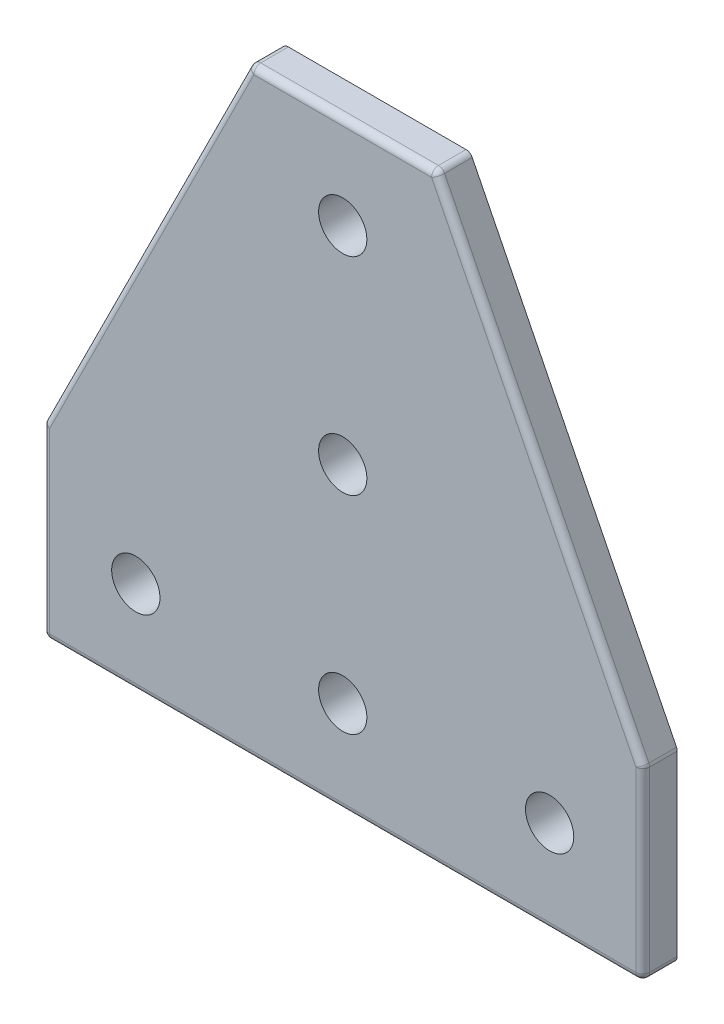
ISO-10303-21;
HEADER;
FILE_DESCRIPTION(('STEP AP214'),'2;1');
FILE_NAME('part.step','',(''),(''),'','','');
FILE_SCHEMA(('AUTOMOTIVE_DESIGN { 1 0 10303 214 1 1 1 1 }'));
ENDSEC;
DATA;
#1=APPLICATION_CONTEXT('core data for automotive mechanical design processes');
#2=APPLICATION_PROTOCOL_DEFINITION('international standard','automotive_design',2000,#1);
#3=PRODUCT_CONTEXT('',#1,'mechanical');
#4=PRODUCT('Part','Part','',(#3));
#5=PRODUCT_RELATED_PRODUCT_CATEGORY('part','',(#4));
#6=PRODUCT_DEFINITION_FORMATION('','',#4);
#7=PRODUCT_DEFINITION_CONTEXT('part definition',#1,'design');
#8=PRODUCT_DEFINITION('design','',#6,#7);
#9=PRODUCT_DEFINITION_SHAPE('','',#8);
#10=(LENGTH_UNIT() NAMED_UNIT(*) SI_UNIT(.MILLI.,.METRE.));
#11=(NAMED_UNIT(*) PLANE_ANGLE_UNIT() SI_UNIT($,.RADIAN.));
#12=(NAMED_UNIT(*) SI_UNIT($,.STERADIAN.) SOLID_ANGLE_UNIT());
#13=UNCERTAINTY_MEASURE_WITH_UNIT(LENGTH_MEASURE(1.E-05),#10,'distance_accuracy_value','');
#14=(GEOMETRIC_REPRESENTATION_CONTEXT(3) GLOBAL_UNCERTAINTY_ASSIGNED_CONTEXT((#13)) GLOBAL_UNIT_ASSIGNED_CONTEXT((#10,
#11,#12)) REPRESENTATION_CONTEXT('',''));
#15=CARTESIAN_POINT('',(0.,0.,0.));
#16=DIRECTION('',(0.,0.,1.));
#17=DIRECTION('',(1.,0.,0.));
#18=AXIS2_PLACEMENT_3D('',#15,#16,#17);
#19=CARTESIAN_POINT('',(0.,0.,2.5));
#20=DIRECTION('',(0.,0.,-1.));
#21=DIRECTION('',(-1.,0.,0.));
#22=AXIS2_PLACEMENT_3D('',#19,#20,#21);
#23=PLANE('',#22);
#24=DIRECTION('',(-0.447213595499958,-0.894427190999916,0.));
#25=VECTOR('',#24,1.);
#26=CARTESIAN_POINT('',(-9.90557280900008,4.95278640450004,2.5));
#27=LINE('',#26,#25);
#28=CARTESIAN_POINT('',(30.6180339887499,86.,2.5));
#29=VERTEX_POINT('',#28);
#30=CARTESIAN_POINT('',(0.999999999999997,26.7639320225002,2.5));
#31=VERTEX_POINT('',#30);
#32=EDGE_CURVE('E214',#29,#31,#27,.T.);
#33=ORIENTED_EDGE('',*,*,#32,.T.);
#34=DIRECTION('',(0.,-1.,0.));
#35=VECTOR('',#34,1.);
#36=CARTESIAN_POINT('',(1.,0.,2.5));
#37=LINE('',#36,#35);
#38=CARTESIAN_POINT('',(1.,1.,2.5));
#39=VERTEX_POINT('',#38);
#40=EDGE_CURVE('E251',#31,#39,#37,.T.);
#41=ORIENTED_EDGE('',*,*,#40,.T.);
#42=DIRECTION('',(1.,0.,0.));
#43=VECTOR('',#42,1.);
#44=CARTESIAN_POINT('',(0.,1.,2.5));
#45=LINE('',#44,#43);
#46=CARTESIAN_POINT('',(86.,1.,2.5));
#47=VERTEX_POINT('',#46);
#48=EDGE_CURVE('E249',#39,#47,#45,.T.);
#49=ORIENTED_EDGE('',*,*,#48,.T.);
#50=DIRECTION('',(0.,1.,0.));
#51=VECTOR('',#50,1.);
#52=CARTESIAN_POINT('',(86.,0.,2.5));
#53=LINE('',#52,#51);
#54=CARTESIAN_POINT('',(86.,26.7639320225002,2.5));
#55=VERTEX_POINT('',#54);
#56=EDGE_CURVE('E210',#47,#55,#53,.T.);
#57=ORIENTED_EDGE('',*,*,#56,.T.);
#58=DIRECTION('',(-0.447213595499958,0.894427190999916,0.));
#59=VECTOR('',#58,1.);
#60=CARTESIAN_POINT('',(79.5055728090001,39.7527864045,2.5));
#61=LINE('',#60,#59);
#62=CARTESIAN_POINT('',(56.3819660112501,86.,2.5));
#63=VERTEX_POINT('',#62);
#64=EDGE_CURVE('E202',#55,#63,#61,.T.);
#65=ORIENTED_EDGE('',*,*,#64,.T.);
#66=DIRECTION('',(-1.,0.,0.));
#67=VECTOR('',#66,1.);
#68=CARTESIAN_POINT('',(0.,86.,2.5));
#69=LINE('',#68,#67);
#70=EDGE_CURVE('E207',#63,#29,#69,.T.);
#71=ORIENTED_EDGE('',*,*,#70,.T.);
#72=EDGE_LOOP('',(#33,#41,#49,#57,#65,#71));
#73=FACE_BOUND('',#72,.T.);
#74=CARTESIAN_POINT('',(43.5,43.5,2.5));
#75=DIRECTION('',(0.,0.,1.));
#76=DIRECTION('',(1.,0.,0.));
#77=AXIS2_PLACEMENT_3D('',#74,#75,#76);
#78=CIRCLE('',#77,3.5);
#79=CARTESIAN_POINT('',(47.,43.5,2.5));
#80=VERTEX_POINT('',#79);
#81=EDGE_CURVE('E344',#80,#80,#78,.T.);
#82=ORIENTED_EDGE('',*,*,#81,.F.);
#83=EDGE_LOOP('',(#82));
#84=FACE_BOUND('',#83,.T.);
#85=CARTESIAN_POINT('',(43.5,13.5,2.5));
#86=DIRECTION('',(0.,0.,1.));
#87=DIRECTION('',(1.,0.,0.));
#88=AXIS2_PLACEMENT_3D('',#85,#86,#87);
#89=CIRCLE('',#88,3.5);
#90=CARTESIAN_POINT('',(47.,13.5,2.5));
#91=VERTEX_POINT('',#90);
#92=EDGE_CURVE('E356',#91,#91,#89,.T.);
#93=ORIENTED_EDGE('',*,*,#92,.F.);
#94=EDGE_LOOP('',(#93));
#95=FACE_BOUND('',#94,.T.);
#96=CARTESIAN_POINT('',(13.5,13.5,2.5));
#97=DIRECTION('',(0.,0.,1.));
#98=DIRECTION('',(1.,0.,0.));
#99=AXIS2_PLACEMENT_3D('',#96,#97,#98);
#100=CIRCLE('',#99,3.5);
#101=CARTESIAN_POINT('',(17.,13.5,2.5));
#102=VERTEX_POINT('',#101);
#103=EDGE_CURVE('E362',#102,#102,#100,.T.);
#104=ORIENTED_EDGE('',*,*,#103,.F.);
#105=EDGE_LOOP('',(#104));
#106=FACE_BOUND('',#105,.T.);
#107=CARTESIAN_POINT('',(73.5,13.5,2.5));
#108=DIRECTION('',(0.,0.,1.));
#109=DIRECTION('',(1.,0.,0.));
#110=AXIS2_PLACEMENT_3D('',#107,#108,#109);
#111=CIRCLE('',#110,3.50000000000001);
#112=CARTESIAN_POINT('',(77.,13.5,2.5));
#113=VERTEX_POINT('',#112);
#114=EDGE_CURVE('E350',#113,#113,#111,.T.);
#115=ORIENTED_EDGE('',*,*,#114,.F.);
#116=EDGE_LOOP('',(#115));
#117=FACE_BOUND('',#116,.T.);
#118=CARTESIAN_POINT('',(43.5,73.5,2.5));
#119=DIRECTION('',(0.,0.,1.));
#120=DIRECTION('',(1.,0.,0.));
#121=AXIS2_PLACEMENT_3D('',#118,#119,#120);
#122=CIRCLE('',#121,3.5);
#123=CARTESIAN_POINT('',(47.,73.5,2.5));
#124=VERTEX_POINT('',#123);
#125=EDGE_CURVE('E336',#124,#124,#122,.T.);
#126=ORIENTED_EDGE('',*,*,#125,.F.);
#127=EDGE_LOOP('',(#126));
#128=FACE_BOUND('',#127,.T.);
#129=ADVANCED_FACE('F96',(#73,#84,#95,#106,#117,#128),#23,.F.);
#130=CARTESIAN_POINT('',(0.,0.,-2.5));
#131=DIRECTION('',(0.,0.,-1.));
#132=DIRECTION('',(-1.,0.,0.));
#133=AXIS2_PLACEMENT_3D('',#130,#131,#132);
#134=PLANE('',#133);
#135=CARTESIAN_POINT('',(43.5,43.5,-2.5));
#136=DIRECTION('',(0.,0.,1.));
#137=DIRECTION('',(1.,0.,0.));
#138=AXIS2_PLACEMENT_3D('',#135,#136,#137);
#139=CIRCLE('',#138,3.5);
#140=CARTESIAN_POINT('',(47.,43.5,-2.5));
#141=VERTEX_POINT('',#140);
#142=EDGE_CURVE('E341',#141,#141,#139,.T.);
#143=ORIENTED_EDGE('',*,*,#142,.T.);
#144=EDGE_LOOP('',(#143));
#145=FACE_BOUND('',#144,.T.);
#146=CARTESIAN_POINT('',(43.5,13.5,-2.5));
#147=DIRECTION('',(0.,0.,1.));
#148=DIRECTION('',(1.,0.,0.));
#149=AXIS2_PLACEMENT_3D('',#146,#147,#148);
#150=CIRCLE('',#149,3.5);
#151=CARTESIAN_POINT('',(47.,13.5,-2.5));
#152=VERTEX_POINT('',#151);
#153=EDGE_CURVE('E353',#152,#152,#150,.T.);
#154=ORIENTED_EDGE('',*,*,#153,.T.);
#155=EDGE_LOOP('',(#154));
#156=FACE_BOUND('',#155,.T.);
#157=DIRECTION('',(-0.447213595499958,-0.894427190999916,0.));
#158=VECTOR('',#157,1.);
#159=CARTESIAN_POINT('',(0.,27.,-2.5));
#160=LINE('',#159,#158);
#161=CARTESIAN_POINT('',(29.72360679775,86.4472135954999,-2.5));
#162=VERTEX_POINT('',#161);
#163=CARTESIAN_POINT('',(0.105572809000081,27.2111456180001,-2.5));
#164=VERTEX_POINT('',#163);
#165=EDGE_CURVE('E243',#162,#164,#160,.T.);
#166=ORIENTED_EDGE('',*,*,#165,.F.);
#167=CARTESIAN_POINT('',(30.6180339887499,86.,-2.5));
#168=DIRECTION('',(0.,0.,-1.));
#169=DIRECTION('',(-1.,0.,0.));
#170=AXIS2_PLACEMENT_3D('',#167,#168,#169);
#171=CIRCLE('',#170,1.);
#172=CARTESIAN_POINT('',(30.6180339887499,87.,-2.5));
#173=VERTEX_POINT('',#172);
#174=EDGE_CURVE('E270',#162,#173,#171,.T.);
#175=ORIENTED_EDGE('',*,*,#174,.T.);
#176=DIRECTION('',(-1.,0.,0.));
#177=VECTOR('',#176,1.);
#178=CARTESIAN_POINT('',(57.,87.,-2.5));
#179=LINE('',#178,#177);
#180=CARTESIAN_POINT('',(56.3819660112501,87.,-2.5));
#181=VERTEX_POINT('',#180);
#182=EDGE_CURVE('E375',#181,#173,#179,.T.);
#183=ORIENTED_EDGE('',*,*,#182,.F.);
#184=CARTESIAN_POINT('',(56.3819660112501,86.,-2.5));
#185=DIRECTION('',(0.,0.,-1.));
#186=DIRECTION('',(-1.,0.,0.));
#187=AXIS2_PLACEMENT_3D('',#184,#185,#186);
#188=CIRCLE('',#187,1.);
#189=CARTESIAN_POINT('',(57.27639320225,86.4472135954999,-2.5));
#190=VERTEX_POINT('',#189);
#191=EDGE_CURVE('E264',#181,#190,#188,.T.);
#192=ORIENTED_EDGE('',*,*,#191,.T.);
#193=DIRECTION('',(-0.447213595499958,0.894427190999916,0.));
#194=VECTOR('',#193,1.);
#195=CARTESIAN_POINT('',(57.,87.,-2.5));
#196=LINE('',#195,#194);
#197=CARTESIAN_POINT('',(86.8944271909999,27.2111456180002,-2.5));
#198=VERTEX_POINT('',#197);
#199=EDGE_CURVE('E372',#198,#190,#196,.T.);
#200=ORIENTED_EDGE('',*,*,#199,.F.);
#201=CARTESIAN_POINT('',(86.,26.7639320225002,-2.5));
#202=DIRECTION('',(0.,0.,-1.));
#203=DIRECTION('',(-1.,0.,0.));
#204=AXIS2_PLACEMENT_3D('',#201,#202,#203);
#205=CIRCLE('',#204,1.);
#206=CARTESIAN_POINT('',(87.,26.7639320225002,-2.5));
#207=VERTEX_POINT('',#206);
#208=EDGE_CURVE('E266',#198,#207,#205,.T.);
#209=ORIENTED_EDGE('',*,*,#208,.T.);
#210=DIRECTION('',(0.,1.,0.));
#211=VECTOR('',#210,1.);
#212=CARTESIAN_POINT('',(87.,27.,-2.5));
#213=LINE('',#212,#211);
#214=CARTESIAN_POINT('',(87.,1.,-2.5));
#215=VERTEX_POINT('',#214);
#216=EDGE_CURVE('E369',#215,#207,#213,.T.);
#217=ORIENTED_EDGE('',*,*,#216,.F.);
#218=CARTESIAN_POINT('',(86.,1.,-2.5));
#219=DIRECTION('',(0.,0.,-1.));
#220=DIRECTION('',(-1.,0.,0.));
#221=AXIS2_PLACEMENT_3D('',#218,#219,#220);
#222=CIRCLE('',#221,1.);
#223=CARTESIAN_POINT('',(86.,0.,-2.5));
#224=VERTEX_POINT('',#223);
#225=EDGE_CURVE('E260',#215,#224,#222,.T.);
#226=ORIENTED_EDGE('',*,*,#225,.T.);
#227=DIRECTION('',(1.,0.,0.));
#228=VECTOR('',#227,1.);
#229=CARTESIAN_POINT('',(87.,0.,-2.5));
#230=LINE('',#229,#228);
#231=CARTESIAN_POINT('',(1.,0.,-2.5));
#232=VERTEX_POINT('',#231);
#233=EDGE_CURVE('E365',#232,#224,#230,.T.);
#234=ORIENTED_EDGE('',*,*,#233,.F.);
#235=CARTESIAN_POINT('',(1.,1.,-2.5));
#236=DIRECTION('',(0.,0.,-1.));
#237=DIRECTION('',(-1.,0.,0.));
#238=AXIS2_PLACEMENT_3D('',#235,#236,#237);
#239=CIRCLE('',#238,1.);
#240=CARTESIAN_POINT('',(0.,1.,-2.5));
#241=VERTEX_POINT('',#240);
#242=EDGE_CURVE('E262',#232,#241,#239,.T.);
#243=ORIENTED_EDGE('',*,*,#242,.T.);
#244=DIRECTION('',(0.,-1.,0.));
#245=VECTOR('',#244,1.);
#246=CARTESIAN_POINT('',(0.,0.,-2.5));
#247=LINE('',#246,#245);
#248=CARTESIAN_POINT('',(0.,26.7639320225002,-2.5));
#249=VERTEX_POINT('',#248);
#250=EDGE_CURVE('E240',#249,#241,#247,.T.);
#251=ORIENTED_EDGE('',*,*,#250,.F.);
#252=CARTESIAN_POINT('',(0.999999999999997,26.7639320225002,-2.5));
#253=DIRECTION('',(0.,0.,-1.));
#254=DIRECTION('',(-1.,0.,0.));
#255=AXIS2_PLACEMENT_3D('',#252,#253,#254);
#256=CIRCLE('',#255,1.);
#257=EDGE_CURVE('E268',#249,#164,#256,.T.);
#258=ORIENTED_EDGE('',*,*,#257,.T.);
#259=EDGE_LOOP('',(#166,#175,#183,#192,#200,#209,#217,#226,#234,#243,#251,#258));
#260=FACE_BOUND('',#259,.T.);
#261=CARTESIAN_POINT('',(13.5,13.5,-2.5));
#262=DIRECTION('',(0.,0.,1.));
#263=DIRECTION('',(1.,0.,0.));
#264=AXIS2_PLACEMENT_3D('',#261,#262,#263);
#265=CIRCLE('',#264,3.5);
#266=CARTESIAN_POINT('',(17.,13.5,-2.5));
#267=VERTEX_POINT('',#266);
#268=EDGE_CURVE('E359',#267,#267,#265,.T.);
#269=ORIENTED_EDGE('',*,*,#268,.T.);
#270=EDGE_LOOP('',(#269));
#271=FACE_BOUND('',#270,.T.);
#272=CARTESIAN_POINT('',(73.5,13.5,-2.5));
#273=DIRECTION('',(0.,0.,1.));
#274=DIRECTION('',(1.,0.,0.));
#275=AXIS2_PLACEMENT_3D('',#272,#273,#274);
#276=CIRCLE('',#275,3.50000000000001);
#277=CARTESIAN_POINT('',(77.,13.5,-2.5));
#278=VERTEX_POINT('',#277);
#279=EDGE_CURVE('E347',#278,#278,#276,.T.);
#280=ORIENTED_EDGE('',*,*,#279,.T.);
#281=EDGE_LOOP('',(#280));
#282=FACE_BOUND('',#281,.T.);
#283=CARTESIAN_POINT('',(43.5,73.5,-2.5));
#284=DIRECTION('',(0.,0.,1.));
#285=DIRECTION('',(1.,0.,0.));
#286=AXIS2_PLACEMENT_3D('',#283,#284,#285);
#287=CIRCLE('',#286,3.5);
#288=CARTESIAN_POINT('',(47.,73.5,-2.5));
#289=VERTEX_POINT('',#288);
#290=EDGE_CURVE('E333',#289,#289,#287,.T.);
#291=ORIENTED_EDGE('',*,*,#290,.T.);
#292=EDGE_LOOP('',(#291));
#293=FACE_BOUND('',#292,.T.);
#294=ADVANCED_FACE('F417',(#145,#156,#260,#271,#282,#293),#134,.T.);
#295=CARTESIAN_POINT('',(87.,0.,2.5));
#296=DIRECTION('',(0.,1.,0.));
#297=DIRECTION('',(-1.,0.,0.));
#298=AXIS2_PLACEMENT_3D('',#295,#296,#297);
#299=PLANE('',#298);
#300=DIRECTION('',(1.,0.,0.));
#301=VECTOR('',#300,1.);
#302=CARTESIAN_POINT('',(87.,0.,1.5));
#303=LINE('',#302,#301);
#304=CARTESIAN_POINT('',(86.,0.,1.5));
#305=VERTEX_POINT('',#304);
#306=CARTESIAN_POINT('',(1.,0.,1.5));
#307=VERTEX_POINT('',#306);
#308=EDGE_CURVE('E105',#305,#307,#303,.F.);
#309=ORIENTED_EDGE('',*,*,#308,.T.);
#310=DIRECTION('',(0.,0.,-1.));
#311=VECTOR('',#310,1.);
#312=CARTESIAN_POINT('',(1.,0.,2.5));
#313=LINE('',#312,#311);
#314=EDGE_CURVE('E12',#307,#232,#313,.T.);
#315=ORIENTED_EDGE('',*,*,#314,.T.);
#316=ORIENTED_EDGE('',*,*,#233,.T.);
#317=DIRECTION('',(0.,0.,-1.));
#318=VECTOR('',#317,1.);
#319=CARTESIAN_POINT('',(86.,0.,2.5));
#320=LINE('',#319,#318);
#321=EDGE_CURVE('E116',#224,#305,#320,.F.);
#322=ORIENTED_EDGE('',*,*,#321,.T.);
#323=EDGE_LOOP('',(#309,#315,#316,#322));
#324=FACE_BOUND('',#323,.T.);
#325=ADVANCED_FACE('F416',(#324),#299,.F.);
#326=CARTESIAN_POINT('',(87.,27.,2.5));
#327=DIRECTION('',(-1.,0.,0.));
#328=DIRECTION('',(0.,0.,1.));
#329=AXIS2_PLACEMENT_3D('',#326,#327,#328);
#330=PLANE('',#329);
#331=ORIENTED_EDGE('',*,*,#216,.T.);
#332=DIRECTION('',(0.,0.,-1.));
#333=VECTOR('',#332,1.);
#334=CARTESIAN_POINT('',(87.,26.7639320225002,2.5));
#335=LINE('',#334,#333);
#336=CARTESIAN_POINT('',(87.,26.7639320225002,1.5));
#337=VERTEX_POINT('',#336);
#338=EDGE_CURVE('E293',#207,#337,#335,.F.);
#339=ORIENTED_EDGE('',*,*,#338,.T.);
#340=DIRECTION('',(0.,1.,0.));
#341=VECTOR('',#340,1.);
#342=CARTESIAN_POINT('',(87.,27.,1.5));
#343=LINE('',#342,#341);
#344=CARTESIAN_POINT('',(87.,1.,1.5));
#345=VERTEX_POINT('',#344);
#346=EDGE_CURVE('E291',#337,#345,#343,.F.);
#347=ORIENTED_EDGE('',*,*,#346,.T.);
#348=DIRECTION('',(0.,0.,-1.));
#349=VECTOR('',#348,1.);
#350=CARTESIAN_POINT('',(87.,1.,2.5));
#351=LINE('',#350,#349);
#352=EDGE_CURVE('E289',#345,#215,#351,.T.);
#353=ORIENTED_EDGE('',*,*,#352,.T.);
#354=EDGE_LOOP('',(#331,#339,#347,#353));
#355=FACE_BOUND('',#354,.T.);
#356=ADVANCED_FACE('F465',(#355),#330,.F.);
#357=CARTESIAN_POINT('',(57.,87.,2.5));
#358=DIRECTION('',(-0.894427190999916,-0.447213595499958,0.));
#359=DIRECTION('',(0.447213595499958,-0.894427190999916,0.));
#360=AXIS2_PLACEMENT_3D('',#357,#358,#359);
#361=PLANE('',#360);
#362=DIRECTION('',(-0.447213595499958,0.894427190999916,0.));
#363=VECTOR('',#362,1.);
#364=CARTESIAN_POINT('',(57.,87.,1.5));
#365=LINE('',#364,#363);
#366=CARTESIAN_POINT('',(57.27639320225,86.4472135954999,1.5));
#367=VERTEX_POINT('',#366);
#368=CARTESIAN_POINT('',(86.8944271909999,27.2111456180002,1.5));
#369=VERTEX_POINT('',#368);
#370=EDGE_CURVE('E221',#367,#369,#365,.F.);
#371=ORIENTED_EDGE('',*,*,#370,.T.);
#372=DIRECTION('',(0.,0.,-1.));
#373=VECTOR('',#372,1.);
#374=CARTESIAN_POINT('',(86.8944271909999,27.2111456180002,2.5));
#375=LINE('',#374,#373);
#376=EDGE_CURVE('E287',#369,#198,#375,.T.);
#377=ORIENTED_EDGE('',*,*,#376,.T.);
#378=ORIENTED_EDGE('',*,*,#199,.T.);
#379=DIRECTION('',(0.,0.,-1.));
#380=VECTOR('',#379,1.);
#381=CARTESIAN_POINT('',(57.27639320225,86.4472135954999,2.5));
#382=LINE('',#381,#380);
#383=EDGE_CURVE('E284',#190,#367,#382,.F.);
#384=ORIENTED_EDGE('',*,*,#383,.T.);
#385=EDGE_LOOP('',(#371,#377,#378,#384));
#386=FACE_BOUND('',#385,.T.);
#387=ADVANCED_FACE('F461',(#386),#361,.F.);
#388=CARTESIAN_POINT('',(57.,87.,2.5));
#389=DIRECTION('',(0.,-1.,0.));
#390=DIRECTION('',(0.,0.,-1.));
#391=AXIS2_PLACEMENT_3D('',#388,#389,#390);
#392=PLANE('',#391);
#393=ORIENTED_EDGE('',*,*,#182,.T.);
#394=DIRECTION('',(0.,0.,-1.));
#395=VECTOR('',#394,1.);
#396=CARTESIAN_POINT('',(30.6180339887499,87.,2.5));
#397=LINE('',#396,#395);
#398=CARTESIAN_POINT('',(30.6180339887499,87.,1.5));
#399=VERTEX_POINT('',#398);
#400=EDGE_CURVE('E276',#173,#399,#397,.F.);
#401=ORIENTED_EDGE('',*,*,#400,.T.);
#402=DIRECTION('',(-1.,0.,0.));
#403=VECTOR('',#402,1.);
#404=CARTESIAN_POINT('',(57.,87.,1.5));
#405=LINE('',#404,#403);
#406=CARTESIAN_POINT('',(56.3819660112501,87.,1.5));
#407=VERTEX_POINT('',#406);
#408=EDGE_CURVE('E272',#399,#407,#405,.F.);
#409=ORIENTED_EDGE('',*,*,#408,.T.);
#410=DIRECTION('',(0.,0.,-1.));
#411=VECTOR('',#410,1.);
#412=CARTESIAN_POINT('',(56.3819660112501,87.,2.5));
#413=LINE('',#412,#411);
#414=EDGE_CURVE('E274',#407,#181,#413,.T.);
#415=ORIENTED_EDGE('',*,*,#414,.T.);
#416=EDGE_LOOP('',(#393,#401,#409,#415));
#417=FACE_BOUND('',#416,.T.);
#418=ADVANCED_FACE('F458',(#417),#392,.F.);
#419=CARTESIAN_POINT('',(0.,27.,2.5));
#420=DIRECTION('',(0.894427190999916,-0.447213595499958,0.));
#421=DIRECTION('',(0.447213595499958,0.894427190999916,0.));
#422=AXIS2_PLACEMENT_3D('',#419,#420,#421);
#423=PLANE('',#422);
#424=DIRECTION('',(-0.447213595499958,-0.894427190999916,0.));
#425=VECTOR('',#424,1.);
#426=CARTESIAN_POINT('',(0.,27.,1.5));
#427=LINE('',#426,#425);
#428=CARTESIAN_POINT('',(0.105572809000081,27.2111456180001,1.5));
#429=VERTEX_POINT('',#428);
#430=CARTESIAN_POINT('',(29.72360679775,86.4472135954999,1.5));
#431=VERTEX_POINT('',#430);
#432=EDGE_CURVE('E255',#429,#431,#427,.F.);
#433=ORIENTED_EDGE('',*,*,#432,.T.);
#434=DIRECTION('',(0.,0.,-1.));
#435=VECTOR('',#434,1.);
#436=CARTESIAN_POINT('',(29.72360679775,86.4472135954999,2.5));
#437=LINE('',#436,#435);
#438=EDGE_CURVE('E258',#431,#162,#437,.T.);
#439=ORIENTED_EDGE('',*,*,#438,.T.);
#440=ORIENTED_EDGE('',*,*,#165,.T.);
#441=DIRECTION('',(0.,0.,-1.));
#442=VECTOR('',#441,1.);
#443=CARTESIAN_POINT('',(0.105572809000081,27.2111456180001,2.5));
#444=LINE('',#443,#442);
#445=EDGE_CURVE('E253',#164,#429,#444,.F.);
#446=ORIENTED_EDGE('',*,*,#445,.T.);
#447=EDGE_LOOP('',(#433,#439,#440,#446));
#448=FACE_BOUND('',#447,.T.);
#449=ADVANCED_FACE('F381',(#448),#423,.F.);
#450=CARTESIAN_POINT('',(0.,0.,2.5));
#451=DIRECTION('',(1.,0.,0.));
#452=DIRECTION('',(0.,1.,0.));
#453=AXIS2_PLACEMENT_3D('',#450,#451,#452);
#454=PLANE('',#453);
#455=DIRECTION('',(0.,-1.,0.));
#456=VECTOR('',#455,1.);
#457=CARTESIAN_POINT('',(0.,0.,1.5));
#458=LINE('',#457,#456);
#459=CARTESIAN_POINT('',(0.,1.,1.5));
#460=VERTEX_POINT('',#459);
#461=CARTESIAN_POINT('',(0.,26.7639320225002,1.5));
#462=VERTEX_POINT('',#461);
#463=EDGE_CURVE('E278',#460,#462,#458,.F.);
#464=ORIENTED_EDGE('',*,*,#463,.T.);
#465=DIRECTION('',(0.,0.,-1.));
#466=VECTOR('',#465,1.);
#467=CARTESIAN_POINT('',(0.,26.7639320225002,2.5));
#468=LINE('',#467,#466);
#469=EDGE_CURVE('E282',#462,#249,#468,.T.);
#470=ORIENTED_EDGE('',*,*,#469,.T.);
#471=ORIENTED_EDGE('',*,*,#250,.T.);
#472=DIRECTION('',(0.,0.,-1.));
#473=VECTOR('',#472,1.);
#474=CARTESIAN_POINT('',(0.,1.,2.5));
#475=LINE('',#474,#473);
#476=EDGE_CURVE('E280',#241,#460,#475,.F.);
#477=ORIENTED_EDGE('',*,*,#476,.T.);
#478=EDGE_LOOP('',(#464,#470,#471,#477));
#479=FACE_BOUND('',#478,.T.);
#480=ADVANCED_FACE('F452',(#479),#454,.F.);
#481=CARTESIAN_POINT('',(13.5,13.5,2.5));
#482=DIRECTION('',(0.,0.,-1.));
#483=DIRECTION('',(-1.,0.,0.));
#484=AXIS2_PLACEMENT_3D('',#481,#482,#483);
#485=CYLINDRICAL_SURFACE('',#484,3.5);
#486=ORIENTED_EDGE('',*,*,#103,.T.);
#487=EDGE_LOOP('',(#486));
#488=FACE_BOUND('',#487,.T.);
#489=ORIENTED_EDGE('',*,*,#268,.F.);
#490=EDGE_LOOP('',(#489));
#491=FACE_BOUND('',#490,.T.);
#492=ADVANCED_FACE('F449',(#488,#491),#485,.F.);
#493=CARTESIAN_POINT('',(43.5,13.5,2.5));
#494=DIRECTION('',(0.,0.,-1.));
#495=DIRECTION('',(-1.,0.,0.));
#496=AXIS2_PLACEMENT_3D('',#493,#494,#495);
#497=CYLINDRICAL_SURFACE('',#496,3.5);
#498=ORIENTED_EDGE('',*,*,#92,.T.);
#499=EDGE_LOOP('',(#498));
#500=FACE_BOUND('',#499,.T.);
#501=ORIENTED_EDGE('',*,*,#153,.F.);
#502=EDGE_LOOP('',(#501));
#503=FACE_BOUND('',#502,.T.);
#504=ADVANCED_FACE('F531',(#500,#503),#497,.F.);
#505=CARTESIAN_POINT('',(73.5,13.5,2.5));
#506=DIRECTION('',(0.,0.,-1.));
#507=DIRECTION('',(-1.,0.,0.));
#508=AXIS2_PLACEMENT_3D('',#505,#506,#507);
#509=CYLINDRICAL_SURFACE('',#508,3.50000000000001);
#510=ORIENTED_EDGE('',*,*,#114,.T.);
#511=EDGE_LOOP('',(#510));
#512=FACE_BOUND('',#511,.T.);
#513=ORIENTED_EDGE('',*,*,#279,.F.);
#514=EDGE_LOOP('',(#513));
#515=FACE_BOUND('',#514,.T.);
#516=ADVANCED_FACE('F525',(#512,#515),#509,.F.);
#517=CARTESIAN_POINT('',(43.5,43.5,2.5));
#518=DIRECTION('',(0.,0.,-1.));
#519=DIRECTION('',(-1.,0.,0.));
#520=AXIS2_PLACEMENT_3D('',#517,#518,#519);
#521=CYLINDRICAL_SURFACE('',#520,3.5);
#522=ORIENTED_EDGE('',*,*,#81,.T.);
#523=EDGE_LOOP('',(#522));
#524=FACE_BOUND('',#523,.T.);
#525=ORIENTED_EDGE('',*,*,#142,.F.);
#526=EDGE_LOOP('',(#525));
#527=FACE_BOUND('',#526,.T.);
#528=ADVANCED_FACE('F519',(#524,#527),#521,.F.);
#529=CARTESIAN_POINT('',(43.5,73.5,2.5));
#530=DIRECTION('',(0.,0.,-1.));
#531=DIRECTION('',(-1.,0.,0.));
#532=AXIS2_PLACEMENT_3D('',#529,#530,#531);
#533=CYLINDRICAL_SURFACE('',#532,3.5);
#534=ORIENTED_EDGE('',*,*,#125,.T.);
#535=EDGE_LOOP('',(#534));
#536=FACE_BOUND('',#535,.T.);
#537=ORIENTED_EDGE('',*,*,#290,.F.);
#538=EDGE_LOOP('',(#537));
#539=FACE_BOUND('',#538,.T.);
#540=ADVANCED_FACE('F514',(#536,#539),#533,.F.);
#541=CARTESIAN_POINT('',(86.,26.7639320225002,2.5));
#542=DIRECTION('',(0.,0.,-1.));
#543=DIRECTION('',(-1.,0.,0.));
#544=AXIS2_PLACEMENT_3D('',#541,#542,#543);
#545=CYLINDRICAL_SURFACE('',#544,1.);
#546=ORIENTED_EDGE('',*,*,#208,.F.);
#547=ORIENTED_EDGE('',*,*,#376,.F.);
#548=CARTESIAN_POINT('',(86.,26.7639320225002,1.5));
#549=DIRECTION('',(0.,0.,1.));
#550=DIRECTION('',(1.,0.,0.));
#551=AXIS2_PLACEMENT_3D('',#548,#549,#550);
#552=CIRCLE('',#551,1.);
#553=EDGE_CURVE('E100',#337,#369,#552,.T.);
#554=ORIENTED_EDGE('',*,*,#553,.F.);
#555=ORIENTED_EDGE('',*,*,#338,.F.);
#556=EDGE_LOOP('',(#546,#547,#554,#555));
#557=FACE_BOUND('',#556,.T.);
#558=ADVANCED_FACE('F98',(#557),#545,.T.);
#559=CARTESIAN_POINT('',(86.,0.,1.5));
#560=DIRECTION('',(0.,1.,0.));
#561=DIRECTION('',(0.,0.,1.));
#562=AXIS2_PLACEMENT_3D('',#559,#560,#561);
#563=CYLINDRICAL_SURFACE('',#562,1.);
#564=CARTESIAN_POINT('',(86.,1.,1.5));
#565=DIRECTION('',(0.,-1.,0.));
#566=DIRECTION('',(0.,0.,-1.));
#567=AXIS2_PLACEMENT_3D('',#564,#565,#566);
#568=CIRCLE('',#567,1.);
#569=EDGE_CURVE('E326',#345,#47,#568,.T.);
#570=ORIENTED_EDGE('',*,*,#569,.F.);
#571=ORIENTED_EDGE('',*,*,#346,.F.);
#572=CARTESIAN_POINT('',(86.,26.7639320225002,1.5));
#573=DIRECTION('',(0.,1.,0.));
#574=DIRECTION('',(-1.,0.,0.));
#575=AXIS2_PLACEMENT_3D('',#572,#573,#574);
#576=CIRCLE('',#575,1.);
#577=EDGE_CURVE('E328',#55,#337,#576,.T.);
#578=ORIENTED_EDGE('',*,*,#577,.F.);
#579=ORIENTED_EDGE('',*,*,#56,.F.);
#580=EDGE_LOOP('',(#570,#571,#578,#579));
#581=FACE_BOUND('',#580,.T.);
#582=ADVANCED_FACE('F430',(#581),#563,.T.);
#583=CARTESIAN_POINT('',(86.,1.,2.5));
#584=DIRECTION('',(0.,0.,-1.));
#585=DIRECTION('',(-1.,0.,0.));
#586=AXIS2_PLACEMENT_3D('',#583,#584,#585);
#587=CYLINDRICAL_SURFACE('',#586,1.);
#588=ORIENTED_EDGE('',*,*,#225,.F.);
#589=ORIENTED_EDGE('',*,*,#352,.F.);
#590=CARTESIAN_POINT('',(86.,1.,1.5));
#591=DIRECTION('',(0.,0.,1.));
#592=DIRECTION('',(1.,0.,0.));
#593=AXIS2_PLACEMENT_3D('',#590,#591,#592);
#594=CIRCLE('',#593,1.);
#595=EDGE_CURVE('E323',#305,#345,#594,.T.);
#596=ORIENTED_EDGE('',*,*,#595,.F.);
#597=ORIENTED_EDGE('',*,*,#321,.F.);
#598=EDGE_LOOP('',(#588,#589,#596,#597));
#599=FACE_BOUND('',#598,.T.);
#600=ADVANCED_FACE('F424',(#599),#587,.T.);
#601=CARTESIAN_POINT('',(86.,26.7639320225002,1.5));
#602=DIRECTION('',(0.,0.,1.));
#603=DIRECTION('',(1.,0.,0.));
#604=AXIS2_PLACEMENT_3D('',#601,#602,#603);
#605=SPHERICAL_SURFACE('',#604,1.);
#606=ORIENTED_EDGE('',*,*,#577,.T.);
#607=ORIENTED_EDGE('',*,*,#553,.T.);
#608=CARTESIAN_POINT('',(86.,26.7639320225002,1.5));
#609=DIRECTION('',(0.447213595499958,-0.894427190999916,0.));
#610=DIRECTION('',(0.894427190999916,0.447213595499958,0.));
#611=AXIS2_PLACEMENT_3D('',#608,#609,#610);
#612=CIRCLE('',#611,1.);
#613=EDGE_CURVE('E321',#55,#369,#612,.F.);
#614=ORIENTED_EDGE('',*,*,#613,.F.);
#615=EDGE_LOOP('',(#606,#607,#614));
#616=FACE_BOUND('',#615,.T.);
#617=ADVANCED_FACE('F431',(#616),#605,.T.);
#618=CARTESIAN_POINT('',(86.,1.,1.5));
#619=DIRECTION('',(0.,0.,1.));
#620=DIRECTION('',(1.,0.,0.));
#621=AXIS2_PLACEMENT_3D('',#618,#619,#620);
#622=SPHERICAL_SURFACE('',#621,1.);
#623=ORIENTED_EDGE('',*,*,#595,.T.);
#624=ORIENTED_EDGE('',*,*,#569,.T.);
#625=CARTESIAN_POINT('',(86.,1.,1.5));
#626=DIRECTION('',(1.,0.,0.));
#627=DIRECTION('',(0.,0.,-1.));
#628=AXIS2_PLACEMENT_3D('',#625,#626,#627);
#629=CIRCLE('',#628,1.);
#630=EDGE_CURVE('E318',#305,#47,#629,.F.);
#631=ORIENTED_EDGE('',*,*,#630,.F.);
#632=EDGE_LOOP('',(#623,#624,#631));
#633=FACE_BOUND('',#632,.T.);
#634=ADVANCED_FACE('F427',(#633),#622,.T.);
#635=CARTESIAN_POINT('',(56.3819660112501,86.,2.5));
#636=DIRECTION('',(0.,0.,-1.));
#637=DIRECTION('',(-1.,0.,0.));
#638=AXIS2_PLACEMENT_3D('',#635,#636,#637);
#639=CYLINDRICAL_SURFACE('',#638,1.);
#640=ORIENTED_EDGE('',*,*,#191,.F.);
#641=ORIENTED_EDGE('',*,*,#414,.F.);
#642=CARTESIAN_POINT('',(56.3819660112501,86.,1.5));
#643=DIRECTION('',(0.,0.,1.));
#644=DIRECTION('',(1.,0.,0.));
#645=AXIS2_PLACEMENT_3D('',#642,#643,#644);
#646=CIRCLE('',#645,1.);
#647=EDGE_CURVE('E225',#367,#407,#646,.T.);
#648=ORIENTED_EDGE('',*,*,#647,.F.);
#649=ORIENTED_EDGE('',*,*,#383,.F.);
#650=EDGE_LOOP('',(#640,#641,#648,#649));
#651=FACE_BOUND('',#650,.T.);
#652=ADVANCED_FACE('F438',(#651),#639,.T.);
#653=CARTESIAN_POINT('',(79.5055728090001,39.7527864045,1.5));
#654=DIRECTION('',(-0.447213595499958,0.894427190999916,0.));
#655=DIRECTION('',(-0.894427190999916,-0.447213595499958,0.));
#656=AXIS2_PLACEMENT_3D('',#653,#654,#655);
#657=CYLINDRICAL_SURFACE('',#656,1.);
#658=ORIENTED_EDGE('',*,*,#613,.T.);
#659=ORIENTED_EDGE('',*,*,#370,.F.);
#660=CARTESIAN_POINT('',(56.3819660112501,86.,1.5));
#661=DIRECTION('',(-0.447213595499961,0.894427190999914,0.));
#662=DIRECTION('',(-0.894427190999915,-0.447213595499961,0.));
#663=AXIS2_PLACEMENT_3D('',#660,#661,#662);
#664=CIRCLE('',#663,1.);
#665=EDGE_CURVE('E218',#63,#367,#664,.T.);
#666=ORIENTED_EDGE('',*,*,#665,.F.);
#667=ORIENTED_EDGE('',*,*,#64,.F.);
#668=EDGE_LOOP('',(#658,#659,#666,#667));
#669=FACE_BOUND('',#668,.T.);
#670=ADVANCED_FACE('F220',(#669),#657,.T.);
#671=CARTESIAN_POINT('',(0.,1.,1.5));
#672=DIRECTION('',(1.,0.,0.));
#673=DIRECTION('',(0.,1.,0.));
#674=AXIS2_PLACEMENT_3D('',#671,#672,#673);
#675=CYLINDRICAL_SURFACE('',#674,1.);
#676=ORIENTED_EDGE('',*,*,#630,.T.);
#677=ORIENTED_EDGE('',*,*,#48,.F.);
#678=CARTESIAN_POINT('',(1.,1.,1.5));
#679=DIRECTION('',(-1.,0.,0.));
#680=DIRECTION('',(0.,0.,1.));
#681=AXIS2_PLACEMENT_3D('',#678,#679,#680);
#682=CIRCLE('',#681,1.);
#683=EDGE_CURVE('E226',#307,#39,#682,.T.);
#684=ORIENTED_EDGE('',*,*,#683,.F.);
#685=ORIENTED_EDGE('',*,*,#308,.F.);
#686=EDGE_LOOP('',(#676,#677,#684,#685));
#687=FACE_BOUND('',#686,.T.);
#688=ADVANCED_FACE('F406',(#687),#675,.T.);
#689=CARTESIAN_POINT('',(1.,1.,2.5));
#690=DIRECTION('',(0.,0.,-1.));
#691=DIRECTION('',(-1.,0.,0.));
#692=AXIS2_PLACEMENT_3D('',#689,#690,#691);
#693=CYLINDRICAL_SURFACE('',#692,1.);
#694=ORIENTED_EDGE('',*,*,#242,.F.);
#695=ORIENTED_EDGE('',*,*,#314,.F.);
#696=CARTESIAN_POINT('',(1.,1.,1.5));
#697=DIRECTION('',(0.,0.,1.));
#698=DIRECTION('',(1.,0.,0.));
#699=AXIS2_PLACEMENT_3D('',#696,#697,#698);
#700=CIRCLE('',#699,1.);
#701=EDGE_CURVE('E233',#460,#307,#700,.T.);
#702=ORIENTED_EDGE('',*,*,#701,.F.);
#703=ORIENTED_EDGE('',*,*,#476,.F.);
#704=EDGE_LOOP('',(#694,#695,#702,#703));
#705=FACE_BOUND('',#704,.T.);
#706=ADVANCED_FACE('F414',(#705),#693,.T.);
#707=CARTESIAN_POINT('',(56.3819660112501,86.,1.5));
#708=DIRECTION('',(0.,0.,1.));
#709=DIRECTION('',(1.,0.,0.));
#710=AXIS2_PLACEMENT_3D('',#707,#708,#709);
#711=SPHERICAL_SURFACE('',#710,1.);
#712=ORIENTED_EDGE('',*,*,#665,.T.);
#713=ORIENTED_EDGE('',*,*,#647,.T.);
#714=CARTESIAN_POINT('',(56.3819660112501,86.,1.5));
#715=DIRECTION('',(1.,0.,0.));
#716=DIRECTION('',(0.,0.,-1.));
#717=AXIS2_PLACEMENT_3D('',#714,#715,#716);
#718=CIRCLE('',#717,1.);
#719=EDGE_CURVE('E229',#63,#407,#718,.F.);
#720=ORIENTED_EDGE('',*,*,#719,.F.);
#721=EDGE_LOOP('',(#712,#713,#720));
#722=FACE_BOUND('',#721,.T.);
#723=ADVANCED_FACE('F230',(#722),#711,.T.);
#724=CARTESIAN_POINT('',(1.,1.,1.5));
#725=DIRECTION('',(0.,0.,1.));
#726=DIRECTION('',(1.,0.,0.));
#727=AXIS2_PLACEMENT_3D('',#724,#725,#726);
#728=SPHERICAL_SURFACE('',#727,1.);
#729=ORIENTED_EDGE('',*,*,#701,.T.);
#730=ORIENTED_EDGE('',*,*,#683,.T.);
#731=CARTESIAN_POINT('',(1.,1.,1.5));
#732=DIRECTION('',(0.,-1.,0.));
#733=DIRECTION('',(1.,0.,0.));
#734=AXIS2_PLACEMENT_3D('',#731,#732,#733);
#735=CIRCLE('',#734,1.);
#736=EDGE_CURVE('E234',#460,#39,#735,.F.);
#737=ORIENTED_EDGE('',*,*,#736,.F.);
#738=EDGE_LOOP('',(#729,#730,#737));
#739=FACE_BOUND('',#738,.T.);
#740=ADVANCED_FACE('F409',(#739),#728,.T.);
#741=CARTESIAN_POINT('',(30.6180339887499,86.,2.5));
#742=DIRECTION('',(0.,0.,-1.));
#743=DIRECTION('',(-1.,0.,0.));
#744=AXIS2_PLACEMENT_3D('',#741,#742,#743);
#745=CYLINDRICAL_SURFACE('',#744,1.);
#746=ORIENTED_EDGE('',*,*,#174,.F.);
#747=ORIENTED_EDGE('',*,*,#438,.F.);
#748=CARTESIAN_POINT('',(30.6180339887499,86.,1.5));
#749=DIRECTION('',(0.,0.,1.));
#750=DIRECTION('',(1.,0.,0.));
#751=AXIS2_PLACEMENT_3D('',#748,#749,#750);
#752=CIRCLE('',#751,1.);
#753=EDGE_CURVE('E308',#399,#431,#752,.T.);
#754=ORIENTED_EDGE('',*,*,#753,.F.);
#755=ORIENTED_EDGE('',*,*,#400,.F.);
#756=EDGE_LOOP('',(#746,#747,#754,#755));
#757=FACE_BOUND('',#756,.T.);
#758=ADVANCED_FACE('F486',(#757),#745,.T.);
#759=CARTESIAN_POINT('',(0.,86.,1.5));
#760=DIRECTION('',(-1.,0.,0.));
#761=DIRECTION('',(0.,0.,1.));
#762=AXIS2_PLACEMENT_3D('',#759,#760,#761);
#763=CYLINDRICAL_SURFACE('',#762,1.);
#764=ORIENTED_EDGE('',*,*,#719,.T.);
#765=ORIENTED_EDGE('',*,*,#408,.F.);
#766=CARTESIAN_POINT('',(30.6180339887499,86.,1.5));
#767=DIRECTION('',(-1.,0.,0.));
#768=DIRECTION('',(0.,-1.,0.));
#769=AXIS2_PLACEMENT_3D('',#766,#767,#768);
#770=CIRCLE('',#769,1.);
#771=EDGE_CURVE('E238',#29,#399,#770,.T.);
#772=ORIENTED_EDGE('',*,*,#771,.F.);
#773=ORIENTED_EDGE('',*,*,#70,.F.);
#774=EDGE_LOOP('',(#764,#765,#772,#773));
#775=FACE_BOUND('',#774,.T.);
#776=ADVANCED_FACE('F236',(#775),#763,.T.);
#777=CARTESIAN_POINT('',(1.,0.,1.5));
#778=DIRECTION('',(0.,-1.,0.));
#779=DIRECTION('',(1.,0.,0.));
#780=AXIS2_PLACEMENT_3D('',#777,#778,#779);
#781=CYLINDRICAL_SURFACE('',#780,1.);
#782=ORIENTED_EDGE('',*,*,#736,.T.);
#783=ORIENTED_EDGE('',*,*,#40,.F.);
#784=CARTESIAN_POINT('',(0.999999999999997,26.7639320225002,1.5));
#785=DIRECTION('',(0.,1.,0.));
#786=DIRECTION('',(0.,0.,1.));
#787=AXIS2_PLACEMENT_3D('',#784,#785,#786);
#788=CIRCLE('',#787,1.);
#789=EDGE_CURVE('E304',#462,#31,#788,.T.);
#790=ORIENTED_EDGE('',*,*,#789,.F.);
#791=ORIENTED_EDGE('',*,*,#463,.F.);
#792=EDGE_LOOP('',(#782,#783,#790,#791));
#793=FACE_BOUND('',#792,.T.);
#794=ADVANCED_FACE('F401',(#793),#781,.T.);
#795=CARTESIAN_POINT('',(0.999999999999997,26.7639320225002,2.5));
#796=DIRECTION('',(0.,0.,-1.));
#797=DIRECTION('',(-1.,0.,0.));
#798=AXIS2_PLACEMENT_3D('',#795,#796,#797);
#799=CYLINDRICAL_SURFACE('',#798,1.);
#800=ORIENTED_EDGE('',*,*,#257,.F.);
#801=ORIENTED_EDGE('',*,*,#469,.F.);
#802=CARTESIAN_POINT('',(0.999999999999997,26.7639320225002,1.5));
#803=DIRECTION('',(0.,0.,1.));
#804=DIRECTION('',(1.,0.,0.));
#805=AXIS2_PLACEMENT_3D('',#802,#803,#804);
#806=CIRCLE('',#805,1.);
#807=EDGE_CURVE('E301',#429,#462,#806,.T.);
#808=ORIENTED_EDGE('',*,*,#807,.F.);
#809=ORIENTED_EDGE('',*,*,#445,.F.);
#810=EDGE_LOOP('',(#800,#801,#808,#809));
#811=FACE_BOUND('',#810,.T.);
#812=ADVANCED_FACE('F388',(#811),#799,.T.);
#813=CARTESIAN_POINT('',(30.6180339887499,86.,1.5));
#814=DIRECTION('',(0.,0.,1.));
#815=DIRECTION('',(1.,0.,0.));
#816=AXIS2_PLACEMENT_3D('',#813,#814,#815);
#817=SPHERICAL_SURFACE('',#816,1.);
#818=ORIENTED_EDGE('',*,*,#771,.T.);
#819=ORIENTED_EDGE('',*,*,#753,.T.);
#820=CARTESIAN_POINT('',(30.6180339887499,86.,1.5));
#821=DIRECTION('',(0.447213595499956,0.894427190999917,0.));
#822=DIRECTION('',(-0.894427190999917,0.447213595499957,0.));
#823=AXIS2_PLACEMENT_3D('',#820,#821,#822);
#824=CIRCLE('',#823,1.);
#825=EDGE_CURVE('E299',#29,#431,#824,.F.);
#826=ORIENTED_EDGE('',*,*,#825,.F.);
#827=EDGE_LOOP('',(#818,#819,#826));
#828=FACE_BOUND('',#827,.T.);
#829=ADVANCED_FACE('F476',(#828),#817,.T.);
#830=CARTESIAN_POINT('',(0.999999999999997,26.7639320225002,1.5));
#831=DIRECTION('',(0.,0.,1.));
#832=DIRECTION('',(1.,0.,0.));
#833=AXIS2_PLACEMENT_3D('',#830,#831,#832);
#834=SPHERICAL_SURFACE('',#833,1.);
#835=ORIENTED_EDGE('',*,*,#807,.T.);
#836=ORIENTED_EDGE('',*,*,#789,.T.);
#837=CARTESIAN_POINT('',(0.999999999999997,26.7639320225002,1.5));
#838=DIRECTION('',(-0.447213595499951,-0.894427190999919,0.));
#839=DIRECTION('',(0.894427190999919,-0.447213595499951,0.));
#840=AXIS2_PLACEMENT_3D('',#837,#838,#839);
#841=CIRCLE('',#840,1.);
#842=EDGE_CURVE('E297',#429,#31,#841,.F.);
#843=ORIENTED_EDGE('',*,*,#842,.F.);
#844=EDGE_LOOP('',(#835,#836,#843));
#845=FACE_BOUND('',#844,.T.);
#846=ADVANCED_FACE('F397',(#845),#834,.T.);
#847=CARTESIAN_POINT('',(-9.90557280900008,4.95278640450004,1.5));
#848=DIRECTION('',(-0.447213595499958,-0.894427190999916,0.));
#849=DIRECTION('',(0.894427190999916,-0.447213595499958,0.));
#850=AXIS2_PLACEMENT_3D('',#847,#848,#849);
#851=CYLINDRICAL_SURFACE('',#850,1.);
#852=ORIENTED_EDGE('',*,*,#825,.T.);
#853=ORIENTED_EDGE('',*,*,#432,.F.);
#854=ORIENTED_EDGE('',*,*,#842,.T.);
#855=ORIENTED_EDGE('',*,*,#32,.F.);
#856=EDGE_LOOP('',(#852,#853,#854,#855));
#857=FACE_BOUND('',#856,.T.);
#858=ADVANCED_FACE('F395',(#857),#851,.T.);
#859=CLOSED_SHELL('',(#129,#294,#325,#356,#387,#418,#449,#480,#492,#504,#516,#528,#540,#558,
#582,#600,#617,#634,#652,#670,#688,#706,#723,#740,#758,#776,#794,#812,#829,#846,#858));
#860=MANIFOLD_SOLID_BREP('B2',#859);
#861=ADVANCED_BREP_SHAPE_REPRESENTATION('',(#18,#860),#14);
#862=SHAPE_DEFINITION_REPRESENTATION(#9,#861);
ENDSEC;
END-ISO-10303-21;
